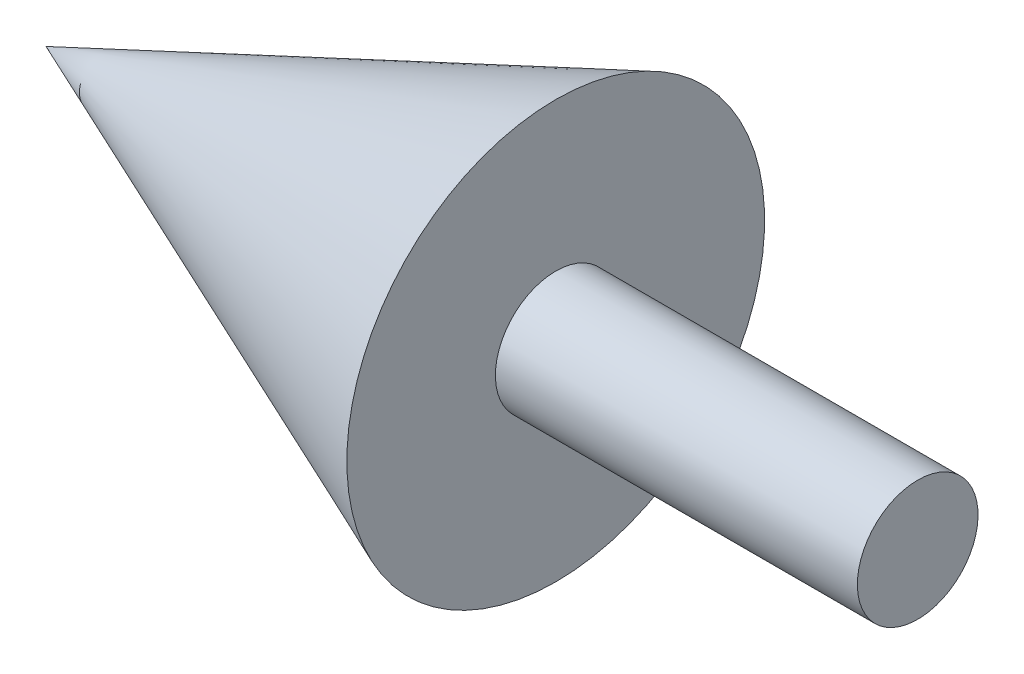
ISO-10303-21;
HEADER;
FILE_DESCRIPTION(('STEP AP214'),'2;1');
FILE_NAME('part.step','',(''),(''),'','','');
FILE_SCHEMA(('AUTOMOTIVE_DESIGN { 1 0 10303 214 1 1 1 1 }'));
ENDSEC;
DATA;
#1=APPLICATION_CONTEXT('core data for automotive mechanical design processes');
#2=APPLICATION_PROTOCOL_DEFINITION('international standard','automotive_design',2000,#1);
#3=PRODUCT_CONTEXT('',#1,'mechanical');
#4=PRODUCT('Part','Part','',(#3));
#5=PRODUCT_RELATED_PRODUCT_CATEGORY('part','',(#4));
#6=PRODUCT_DEFINITION_FORMATION('','',#4);
#7=PRODUCT_DEFINITION_CONTEXT('part definition',#1,'design');
#8=PRODUCT_DEFINITION('design','',#6,#7);
#9=PRODUCT_DEFINITION_SHAPE('','',#8);
#10=(LENGTH_UNIT() NAMED_UNIT(*) SI_UNIT(.MILLI.,.METRE.));
#11=(NAMED_UNIT(*) PLANE_ANGLE_UNIT() SI_UNIT($,.RADIAN.));
#12=(NAMED_UNIT(*) SI_UNIT($,.STERADIAN.) SOLID_ANGLE_UNIT());
#13=UNCERTAINTY_MEASURE_WITH_UNIT(LENGTH_MEASURE(1.E-05),#10,'distance_accuracy_value','');
#14=(GEOMETRIC_REPRESENTATION_CONTEXT(3) GLOBAL_UNCERTAINTY_ASSIGNED_CONTEXT((#13)) GLOBAL_UNIT_ASSIGNED_CONTEXT((#10,
#11,#12)) REPRESENTATION_CONTEXT('',''));
#15=CARTESIAN_POINT('',(0.,0.,0.));
#16=DIRECTION('',(0.,0.,1.));
#17=DIRECTION('',(1.,0.,0.));
#18=AXIS2_PLACEMENT_3D('',#15,#16,#17);
#19=CARTESIAN_POINT('',(30.,0.,0.));
#20=DIRECTION('',(1.,0.,0.));
#21=DIRECTION('',(0.,1.,0.));
#22=AXIS2_PLACEMENT_3D('',#19,#20,#21);
#23=CONICAL_SURFACE('',#22,17.3133010833939,0.388944608545943);
#24=CARTESIAN_POINT('',(-12.2459320668065,0.,0.));
#25=VERTEX_POINT('',#24);
#26=VERTEX_LOOP('',#25);
#27=FACE_BOUND('',#26,.T.);
#28=CARTESIAN_POINT('',(30.,0.,0.));
#29=DIRECTION('',(1.,0.,0.));
#30=DIRECTION('',(0.,1.,0.));
#31=AXIS2_PLACEMENT_3D('',#28,#29,#30);
#32=CIRCLE('',#31,17.3133010833939);
#33=CARTESIAN_POINT('',(30.,17.3133010833939,0.));
#34=VERTEX_POINT('',#33);
#35=EDGE_CURVE('E11',#34,#34,#32,.T.);
#36=ORIENTED_EDGE('',*,*,#35,.F.);
#37=EDGE_LOOP('',(#36));
#38=FACE_BOUND('',#37,.T.);
#39=ADVANCED_FACE('F34',(#27,#38),#23,.T.);
#40=CARTESIAN_POINT('',(30.,5.,0.));
#41=DIRECTION('',(1.,0.,0.));
#42=DIRECTION('',(0.,1.,0.));
#43=AXIS2_PLACEMENT_3D('',#40,#41,#42);
#44=PLANE('',#43);
#45=ORIENTED_EDGE('',*,*,#35,.T.);
#46=EDGE_LOOP('',(#45));
#47=FACE_BOUND('',#46,.T.);
#48=CARTESIAN_POINT('',(30.,0.,0.));
#49=DIRECTION('',(1.,0.,0.));
#50=DIRECTION('',(0.,1.,0.));
#51=AXIS2_PLACEMENT_3D('',#48,#49,#50);
#52=CIRCLE('',#51,5.);
#53=CARTESIAN_POINT('',(30.,5.,0.));
#54=VERTEX_POINT('',#53);
#55=EDGE_CURVE('E40',#54,#54,#52,.T.);
#56=ORIENTED_EDGE('',*,*,#55,.F.);
#57=EDGE_LOOP('',(#56));
#58=FACE_BOUND('',#57,.T.);
#59=ADVANCED_FACE('F45',(#47,#58),#44,.T.);
#60=CARTESIAN_POINT('',(60.,0.,0.));
#61=DIRECTION('',(1.,0.,0.));
#62=DIRECTION('',(0.,1.,0.));
#63=AXIS2_PLACEMENT_3D('',#60,#61,#62);
#64=CYLINDRICAL_SURFACE('',#63,5.);
#65=ORIENTED_EDGE('',*,*,#55,.T.);
#66=EDGE_LOOP('',(#65));
#67=FACE_BOUND('',#66,.T.);
#68=CARTESIAN_POINT('',(60.,0.,0.));
#69=DIRECTION('',(1.,0.,0.));
#70=DIRECTION('',(0.,1.,0.));
#71=AXIS2_PLACEMENT_3D('',#68,#69,#70);
#72=CIRCLE('',#71,5.);
#73=CARTESIAN_POINT('',(60.,5.,0.));
#74=VERTEX_POINT('',#73);
#75=EDGE_CURVE('E54',#74,#74,#72,.T.);
#76=ORIENTED_EDGE('',*,*,#75,.F.);
#77=EDGE_LOOP('',(#76));
#78=FACE_BOUND('',#77,.T.);
#79=ADVANCED_FACE('F50',(#67,#78),#64,.T.);
#80=CARTESIAN_POINT('',(60.,5.,0.));
#81=DIRECTION('',(1.,0.,0.));
#82=DIRECTION('',(0.,1.,0.));
#83=AXIS2_PLACEMENT_3D('',#80,#81,#82);
#84=PLANE('',#83);
#85=ORIENTED_EDGE('',*,*,#75,.T.);
#86=EDGE_LOOP('',(#85));
#87=FACE_BOUND('',#86,.T.);
#88=ADVANCED_FACE('F59',(#87),#84,.T.);
#89=CLOSED_SHELL('',(#39,#59,#79,#88));
#90=MANIFOLD_SOLID_BREP('B2',#89);
#91=ADVANCED_BREP_SHAPE_REPRESENTATION('',(#18,#90),#14);
#92=SHAPE_DEFINITION_REPRESENTATION(#9,#91);
ENDSEC;
END-ISO-10303-21;
